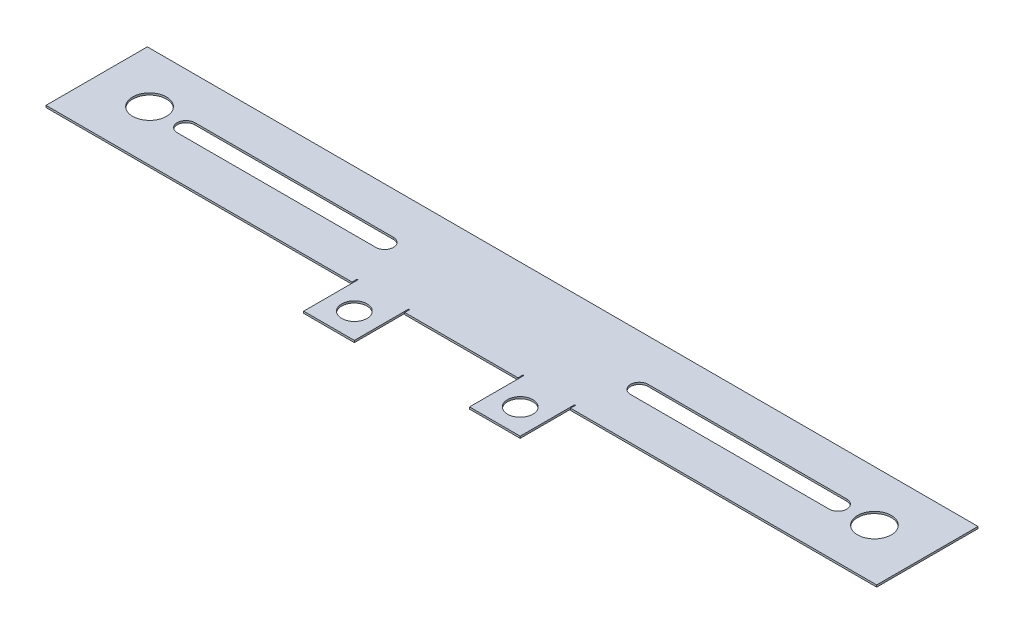
ISO-10303-21;
HEADER;
FILE_DESCRIPTION(('STEP AP214'),'2;1');
FILE_NAME('part.step','',(''),(''),'','','');
FILE_SCHEMA(('AUTOMOTIVE_DESIGN { 1 0 10303 214 1 1 1 1 }'));
ENDSEC;
DATA;
#1=APPLICATION_CONTEXT('core data for automotive mechanical design processes');
#2=APPLICATION_PROTOCOL_DEFINITION('international standard','automotive_design',2000,#1);
#3=PRODUCT_CONTEXT('',#1,'mechanical');
#4=PRODUCT('Part','Part','',(#3));
#5=PRODUCT_RELATED_PRODUCT_CATEGORY('part','',(#4));
#6=PRODUCT_DEFINITION_FORMATION('','',#4);
#7=PRODUCT_DEFINITION_CONTEXT('part definition',#1,'design');
#8=PRODUCT_DEFINITION('design','',#6,#7);
#9=PRODUCT_DEFINITION_SHAPE('','',#8);
#10=(LENGTH_UNIT() NAMED_UNIT(*) SI_UNIT(.MILLI.,.METRE.));
#11=(NAMED_UNIT(*) PLANE_ANGLE_UNIT() SI_UNIT($,.RADIAN.));
#12=(NAMED_UNIT(*) SI_UNIT($,.STERADIAN.) SOLID_ANGLE_UNIT());
#13=UNCERTAINTY_MEASURE_WITH_UNIT(LENGTH_MEASURE(1.E-05),#10,'distance_accuracy_value','');
#14=(GEOMETRIC_REPRESENTATION_CONTEXT(3) GLOBAL_UNCERTAINTY_ASSIGNED_CONTEXT((#13)) GLOBAL_UNIT_ASSIGNED_CONTEXT((#10,
#11,#12)) REPRESENTATION_CONTEXT('',''));
#15=CARTESIAN_POINT('',(0.,0.,0.));
#16=DIRECTION('',(0.,0.,1.));
#17=DIRECTION('',(1.,0.,0.));
#18=AXIS2_PLACEMENT_3D('',#15,#16,#17);
#19=CARTESIAN_POINT('',(-74.2260306865542,-15.1383999999999,-19.05));
#20=DIRECTION('',(0.,0.,-1.));
#21=DIRECTION('',(0.,-1.,0.));
#22=AXIS2_PLACEMENT_3D('',#19,#20,#21);
#23=PLANE('',#22);
#24=DIRECTION('',(1.,0.,0.));
#25=VECTOR('',#24,1.);
#26=CARTESIAN_POINT('',(-74.9626306865541,-15.8749999999999,-19.05));
#27=LINE('',#26,#25);
#28=CARTESIAN_POINT('',(-247.02729221072,-15.8749999999998,-19.05));
#29=VERTEX_POINT('',#28);
#30=CARTESIAN_POINT('',(65.3520308376111,-15.875,-19.05));
#31=VERTEX_POINT('',#30);
#32=EDGE_CURVE('E291',#29,#31,#27,.T.);
#33=ORIENTED_EDGE('',*,*,#32,.T.);
#34=DIRECTION('',(0.,-1.,0.));
#35=VECTOR('',#34,1.);
#36=CARTESIAN_POINT('',(65.3520308376111,-16.6116,-19.05));
#37=LINE('',#36,#35);
#38=CARTESIAN_POINT('',(65.3520308376111,-16.6116,-19.05));
#39=VERTEX_POINT('',#38);
#40=EDGE_CURVE('E688',#31,#39,#37,.T.);
#41=ORIENTED_EDGE('',*,*,#40,.T.);
#42=DIRECTION('',(-1.,0.,0.));
#43=VECTOR('',#42,1.);
#44=CARTESIAN_POINT('',(-74.9626306865541,-16.6115999999999,-19.05));
#45=LINE('',#44,#43);
#46=CARTESIAN_POINT('',(-247.02729221072,-16.6115999999998,-19.05));
#47=VERTEX_POINT('',#46);
#48=EDGE_CURVE('E185',#47,#39,#45,.F.);
#49=ORIENTED_EDGE('',*,*,#48,.F.);
#50=DIRECTION('',(0.,-1.,0.));
#51=VECTOR('',#50,1.);
#52=CARTESIAN_POINT('',(-247.02729221072,-16.6115999999998,-19.05));
#53=LINE('',#52,#51);
#54=EDGE_CURVE('E430',#29,#47,#53,.T.);
#55=ORIENTED_EDGE('',*,*,#54,.F.);
#56=EDGE_LOOP('',(#33,#41,#49,#55));
#57=FACE_BOUND('',#56,.T.);
#58=ADVANCED_FACE('F181',(#57),#23,.T.);
#59=CARTESIAN_POINT('',(-107.449230686554,-15.1383999999999,19.05));
#60=DIRECTION('',(0.,0.,1.));
#61=DIRECTION('',(0.,1.,0.));
#62=AXIS2_PLACEMENT_3D('',#59,#60,#61);
#63=PLANE('',#62);
#64=DIRECTION('',(1.,0.,0.));
#65=VECTOR('',#64,1.);
#66=CARTESIAN_POINT('',(-74.9626306865541,-15.8749999999999,19.05));
#67=LINE('',#66,#65);
#68=CARTESIAN_POINT('',(-112.126179988145,-15.8749999999999,19.05));
#69=VERTEX_POINT('',#68);
#70=CARTESIAN_POINT('',(-69.5490813849629,-15.8749999999999,19.05));
#71=VERTEX_POINT('',#70);
#72=EDGE_CURVE('E192',#69,#71,#67,.T.);
#73=ORIENTED_EDGE('',*,*,#72,.F.);
#74=DIRECTION('',(0.,1.,0.));
#75=VECTOR('',#74,1.);
#76=CARTESIAN_POINT('',(-112.126179988145,-16.6115999999999,19.05));
#77=LINE('',#76,#75);
#78=CARTESIAN_POINT('',(-112.126179988145,-16.6115999999999,19.05));
#79=VERTEX_POINT('',#78);
#80=EDGE_CURVE('E488',#79,#69,#77,.T.);
#81=ORIENTED_EDGE('',*,*,#80,.F.);
#82=DIRECTION('',(-1.,0.,0.));
#83=VECTOR('',#82,1.);
#84=CARTESIAN_POINT('',(-74.9626306865541,-16.6115999999999,19.05));
#85=LINE('',#84,#83);
#86=CARTESIAN_POINT('',(-69.5490813849629,-16.6115999999999,19.05));
#87=VERTEX_POINT('',#86);
#88=EDGE_CURVE('E13',#79,#87,#85,.F.);
#89=ORIENTED_EDGE('',*,*,#88,.T.);
#90=DIRECTION('',(0.,1.,0.));
#91=VECTOR('',#90,1.);
#92=CARTESIAN_POINT('',(-69.5490813849629,-16.6115999999999,19.05));
#93=LINE('',#92,#91);
#94=EDGE_CURVE('E546',#87,#71,#93,.T.);
#95=ORIENTED_EDGE('',*,*,#94,.T.);
#96=EDGE_LOOP('',(#73,#81,#89,#95));
#97=FACE_BOUND('',#96,.T.);
#98=ADVANCED_FACE('F719',(#97),#63,.T.);
#99=CARTESIAN_POINT('',(63.5,-15.875,19.05));
#100=DIRECTION('',(0.,1.,0.));
#101=DIRECTION('',(-1.,0.,0.));
#102=AXIS2_PLACEMENT_3D('',#99,#100,#101);
#103=PLANE('',#102);
#104=ORIENTED_EDGE('',*,*,#32,.F.);
#105=DIRECTION('',(0.,0.,1.));
#106=VECTOR('',#105,1.);
#107=CARTESIAN_POINT('',(-247.02729221072,-15.8749999999998,0.));
#108=LINE('',#107,#106);
#109=CARTESIAN_POINT('',(-247.02729221072,-15.8749999999998,19.05));
#110=VERTEX_POINT('',#109);
#111=EDGE_CURVE('E412',#29,#110,#108,.T.);
#112=ORIENTED_EDGE('',*,*,#111,.T.);
#113=DIRECTION('',(1.,0.,0.));
#114=VECTOR('',#113,1.);
#115=CARTESIAN_POINT('',(-142.978696977874,-15.8749999999999,19.05));
#116=LINE('',#115,#114);
#117=CARTESIAN_POINT('',(-131.912779988145,-15.8749999999999,19.05));
#118=VERTEX_POINT('',#117);
#119=EDGE_CURVE('E395',#110,#118,#116,.T.);
#120=ORIENTED_EDGE('',*,*,#119,.T.);
#121=DIRECTION('',(0.,0.,-1.));
#122=VECTOR('',#121,1.);
#123=CARTESIAN_POINT('',(-131.912779988145,-15.8749999999999,19.05));
#124=LINE('',#123,#122);
#125=CARTESIAN_POINT('',(-131.912779988145,-15.8749999999999,17.2085));
#126=VERTEX_POINT('',#125);
#127=EDGE_CURVE('E407',#118,#126,#124,.T.);
#128=ORIENTED_EDGE('',*,*,#127,.T.);
#129=DIRECTION('',(1.,0.,0.));
#130=VECTOR('',#129,1.);
#131=CARTESIAN_POINT('',(-142.978696977874,-15.8749999999999,17.2085));
#132=LINE('',#131,#130);
#133=CARTESIAN_POINT('',(-131.544479988145,-15.8749999999999,17.2085));
#134=VERTEX_POINT('',#133);
#135=EDGE_CURVE('E455',#126,#134,#132,.T.);
#136=ORIENTED_EDGE('',*,*,#135,.T.);
#137=DIRECTION('',(0.,0.,1.));
#138=VECTOR('',#137,1.);
#139=CARTESIAN_POINT('',(-131.544479988145,-15.8749999999999,1.96417286147569));
#140=LINE('',#139,#138);
#141=CARTESIAN_POINT('',(-131.544479988145,-15.8749999999998,37.6257728614757));
#142=VERTEX_POINT('',#141);
#143=EDGE_CURVE('E517',#134,#142,#140,.T.);
#144=ORIENTED_EDGE('',*,*,#143,.T.);
#145=DIRECTION('',(1.,0.,0.));
#146=VECTOR('',#145,1.);
#147=CARTESIAN_POINT('',(-170.47500354803,-15.8749999999998,37.6257728614757));
#148=LINE('',#147,#146);
#149=CARTESIAN_POINT('',(-112.494479988145,-15.8749999999998,37.6257728614757));
#150=VERTEX_POINT('',#149);
#151=EDGE_CURVE('E514',#142,#150,#148,.T.);
#152=ORIENTED_EDGE('',*,*,#151,.T.);
#153=DIRECTION('',(0.,0.,-1.));
#154=VECTOR('',#153,1.);
#155=CARTESIAN_POINT('',(-112.494479988145,-15.8749999999999,1.96417286147569));
#156=LINE('',#155,#154);
#157=CARTESIAN_POINT('',(-112.494479988145,-15.8749999999999,17.2085));
#158=VERTEX_POINT('',#157);
#159=EDGE_CURVE('E511',#150,#158,#156,.T.);
#160=ORIENTED_EDGE('',*,*,#159,.T.);
#161=DIRECTION('',(1.,0.,0.));
#162=VECTOR('',#161,1.);
#163=CARTESIAN_POINT('',(-142.978696977874,-15.8749999999999,17.2085));
#164=LINE('',#163,#162);
#165=CARTESIAN_POINT('',(-112.126179988145,-15.8749999999999,17.2085));
#166=VERTEX_POINT('',#165);
#167=EDGE_CURVE('E452',#158,#166,#164,.T.);
#168=ORIENTED_EDGE('',*,*,#167,.T.);
#169=DIRECTION('',(0.,0.,1.));
#170=VECTOR('',#169,1.);
#171=CARTESIAN_POINT('',(-112.126179988145,-15.8749999999999,19.05));
#172=LINE('',#171,#170);
#173=EDGE_CURVE('E447',#166,#69,#172,.T.);
#174=ORIENTED_EDGE('',*,*,#173,.T.);
#175=ORIENTED_EDGE('',*,*,#72,.T.);
#176=DIRECTION('',(0.,0.,-1.));
#177=VECTOR('',#176,1.);
#178=CARTESIAN_POINT('',(-69.5490813849629,-15.8749999999999,19.05));
#179=LINE('',#178,#177);
#180=CARTESIAN_POINT('',(-69.5490813849629,-15.8749999999999,17.2085));
#181=VERTEX_POINT('',#180);
#182=EDGE_CURVE('E561',#71,#181,#179,.T.);
#183=ORIENTED_EDGE('',*,*,#182,.T.);
#184=DIRECTION('',(1.,0.,0.));
#185=VECTOR('',#184,1.);
#186=CARTESIAN_POINT('',(-38.6965643952344,-15.8749999999999,17.2085));
#187=LINE('',#186,#185);
#188=CARTESIAN_POINT('',(-69.1807813849629,-15.8749999999999,17.2085));
#189=VERTEX_POINT('',#188);
#190=EDGE_CURVE('E557',#181,#189,#187,.T.);
#191=ORIENTED_EDGE('',*,*,#190,.T.);
#192=DIRECTION('',(0.,0.,1.));
#193=VECTOR('',#192,1.);
#194=CARTESIAN_POINT('',(-69.1807813849629,-15.8749999999999,18.5757728614757));
#195=LINE('',#194,#193);
#196=CARTESIAN_POINT('',(-69.1807813849629,-15.8749999999998,37.6257728614757));
#197=VERTEX_POINT('',#196);
#198=EDGE_CURVE('E624',#197,#189,#195,.F.);
#199=ORIENTED_EDGE('',*,*,#198,.F.);
#200=DIRECTION('',(1.,0.,0.));
#201=VECTOR('',#200,1.);
#202=CARTESIAN_POINT('',(-69.1807813849629,-15.8749999999998,37.6257728614757));
#203=LINE('',#202,#201);
#204=CARTESIAN_POINT('',(-50.1307813849629,-15.8749999999999,37.6257728614757));
#205=VERTEX_POINT('',#204);
#206=EDGE_CURVE('E634',#205,#197,#203,.F.);
#207=ORIENTED_EDGE('',*,*,#206,.F.);
#208=DIRECTION('',(0.,0.,-1.));
#209=VECTOR('',#208,1.);
#210=CARTESIAN_POINT('',(-50.1307813849629,-15.8749999999999,37.6257728614757));
#211=LINE('',#210,#209);
#212=CARTESIAN_POINT('',(-50.1307813849629,-15.8749999999999,17.2085));
#213=VERTEX_POINT('',#212);
#214=EDGE_CURVE('E642',#213,#205,#211,.F.);
#215=ORIENTED_EDGE('',*,*,#214,.F.);
#216=DIRECTION('',(1.,0.,0.));
#217=VECTOR('',#216,1.);
#218=CARTESIAN_POINT('',(-38.6965643952344,-15.8749999999999,17.2085));
#219=LINE('',#218,#217);
#220=CARTESIAN_POINT('',(-49.7624813849629,-15.8749999999999,17.2085));
#221=VERTEX_POINT('',#220);
#222=EDGE_CURVE('E554',#213,#221,#219,.T.);
#223=ORIENTED_EDGE('',*,*,#222,.T.);
#224=DIRECTION('',(0.,0.,1.));
#225=VECTOR('',#224,1.);
#226=CARTESIAN_POINT('',(-49.7624813849629,-15.8749999999999,19.05));
#227=LINE('',#226,#225);
#228=CARTESIAN_POINT('',(-49.7624813849629,-15.8749999999999,19.05));
#229=VERTEX_POINT('',#228);
#230=EDGE_CURVE('E550',#221,#229,#227,.T.);
#231=ORIENTED_EDGE('',*,*,#230,.T.);
#232=DIRECTION('',(1.,0.,0.));
#233=VECTOR('',#232,1.);
#234=CARTESIAN_POINT('',(64.9298475640698,-15.875,19.05));
#235=LINE('',#234,#233);
#236=CARTESIAN_POINT('',(65.3520308376111,-15.875,19.05));
#237=VERTEX_POINT('',#236);
#238=EDGE_CURVE('E681',#229,#237,#235,.T.);
#239=ORIENTED_EDGE('',*,*,#238,.T.);
#240=DIRECTION('',(0.,0.,1.));
#241=VECTOR('',#240,1.);
#242=CARTESIAN_POINT('',(65.3520308376111,-15.875,0.));
#243=LINE('',#242,#241);
#244=EDGE_CURVE('E685',#237,#31,#243,.F.);
#245=ORIENTED_EDGE('',*,*,#244,.T.);
#246=EDGE_LOOP('',(#104,#112,#120,#128,#136,#144,#152,#160,#168,#174,#175,#183,#191,#199,#207,
#215,#223,#231,#239,#245));
#247=FACE_BOUND('',#246,.T.);
#248=CARTESIAN_POINT('',(-213.425261373108,-15.8749999999998,0.));
#249=DIRECTION('',(0.,1.,0.));
#250=DIRECTION('',(-1.,0.,0.));
#251=AXIS2_PLACEMENT_3D('',#248,#249,#250);
#252=CIRCLE('',#251,3.30200000000001);
#253=CARTESIAN_POINT('',(-213.425261373108,-15.8749999999998,-3.30200000000003));
#254=VERTEX_POINT('',#253);
#255=CARTESIAN_POINT('',(-213.425261373109,-15.8749999999999,3.302));
#256=VERTEX_POINT('',#255);
#257=EDGE_CURVE('E797',#254,#256,#252,.T.);
#258=ORIENTED_EDGE('',*,*,#257,.F.);
#259=DIRECTION('',(-1.,0.,0.));
#260=VECTOR('',#259,1.);
#261=CARTESIAN_POINT('',(-142.978696977874,-15.8749999999999,-3.30200000000001));
#262=LINE('',#261,#260);
#263=CARTESIAN_POINT('',(-138.72500354803,-15.8749999999999,-3.30200000000002));
#264=VERTEX_POINT('',#263);
#265=EDGE_CURVE('E373',#264,#254,#262,.T.);
#266=ORIENTED_EDGE('',*,*,#265,.F.);
#267=CARTESIAN_POINT('',(-138.72500354803,-15.8749999999999,0.));
#268=DIRECTION('',(0.,1.,0.));
#269=DIRECTION('',(-1.,0.,0.));
#270=AXIS2_PLACEMENT_3D('',#267,#268,#269);
#271=CIRCLE('',#270,3.30200000000001);
#272=CARTESIAN_POINT('',(-138.72500354803,-15.8749999999999,3.30200000000001));
#273=VERTEX_POINT('',#272);
#274=EDGE_CURVE('E502',#273,#264,#271,.T.);
#275=ORIENTED_EDGE('',*,*,#274,.F.);
#276=DIRECTION('',(1.,0.,0.));
#277=VECTOR('',#276,1.);
#278=CARTESIAN_POINT('',(-142.978696977874,-15.8749999999999,3.30200000000001));
#279=LINE('',#278,#277);
#280=EDGE_CURVE('E508',#256,#273,#279,.T.);
#281=ORIENTED_EDGE('',*,*,#280,.F.);
#282=EDGE_LOOP('',(#258,#266,#275,#281));
#283=FACE_BOUND('',#282,.T.);
#284=DIRECTION('',(-1.,0.,0.));
#285=VECTOR('',#284,1.);
#286=CARTESIAN_POINT('',(63.5,-15.875,-3.30200000000003));
#287=LINE('',#286,#285);
#288=CARTESIAN_POINT('',(31.75,-15.875,-3.30200000000002));
#289=VERTEX_POINT('',#288);
#290=CARTESIAN_POINT('',(-42.9502578250785,-15.8749999999999,-3.30200000000002));
#291=VERTEX_POINT('',#290);
#292=EDGE_CURVE('E664',#289,#291,#287,.T.);
#293=ORIENTED_EDGE('',*,*,#292,.F.);
#294=CARTESIAN_POINT('',(31.75,-15.875,0.));
#295=DIRECTION('',(0.,1.,0.));
#296=DIRECTION('',(-1.,0.,0.));
#297=AXIS2_PLACEMENT_3D('',#294,#295,#296);
#298=CIRCLE('',#297,3.30200000000001);
#299=CARTESIAN_POINT('',(31.75,-15.875,3.302));
#300=VERTEX_POINT('',#299);
#301=EDGE_CURVE('E667',#300,#289,#298,.T.);
#302=ORIENTED_EDGE('',*,*,#301,.F.);
#303=DIRECTION('',(1.,0.,0.));
#304=VECTOR('',#303,1.);
#305=CARTESIAN_POINT('',(63.5,-15.875,3.30199999999999));
#306=LINE('',#305,#304);
#307=CARTESIAN_POINT('',(-42.9502578250785,-15.8749999999999,3.30200000000001));
#308=VERTEX_POINT('',#307);
#309=EDGE_CURVE('E674',#308,#300,#306,.T.);
#310=ORIENTED_EDGE('',*,*,#309,.F.);
#311=CARTESIAN_POINT('',(-42.9502578250785,-15.8749999999999,0.));
#312=DIRECTION('',(0.,1.,0.));
#313=DIRECTION('',(-1.,0.,0.));
#314=AXIS2_PLACEMENT_3D('',#311,#312,#313);
#315=CIRCLE('',#314,3.30200000000001);
#316=EDGE_CURVE('E606',#291,#308,#315,.T.);
#317=ORIENTED_EDGE('',*,*,#316,.F.);
#318=EDGE_LOOP('',(#293,#302,#310,#317));
#319=FACE_BOUND('',#318,.T.);
#320=CARTESIAN_POINT('',(45.4566728135002,-15.875,0.));
#321=DIRECTION('',(0.,1.,0.));
#322=DIRECTION('',(-1.,0.,0.));
#323=AXIS2_PLACEMENT_3D('',#320,#321,#322);
#324=CIRCLE('',#323,6.35);
#325=CARTESIAN_POINT('',(39.1066728135002,-15.875,0.));
#326=VERTEX_POINT('',#325);
#327=EDGE_CURVE('E677',#326,#326,#324,.T.);
#328=ORIENTED_EDGE('',*,*,#327,.F.);
#329=EDGE_LOOP('',(#328));
#330=FACE_BOUND('',#329,.T.);
#331=CARTESIAN_POINT('',(-59.6557813849629,-15.8749999999999,28.1007728614757));
#332=DIRECTION('',(0.,-1.,0.));
#333=DIRECTION('',(-1.,0.,0.));
#334=AXIS2_PLACEMENT_3D('',#331,#332,#333);
#335=CIRCLE('',#334,4.7625);
#336=CARTESIAN_POINT('',(-64.4182813849629,-15.8749999999999,28.1007728614757));
#337=VERTEX_POINT('',#336);
#338=EDGE_CURVE('E610',#337,#337,#335,.T.);
#339=ORIENTED_EDGE('',*,*,#338,.T.);
#340=EDGE_LOOP('',(#339));
#341=FACE_BOUND('',#340,.T.);
#342=CARTESIAN_POINT('',(-122.019479988145,-15.8749999999999,28.1007728614757));
#343=DIRECTION('',(0.,-1.,0.));
#344=DIRECTION('',(1.,0.,0.));
#345=AXIS2_PLACEMENT_3D('',#342,#343,#344);
#346=CIRCLE('',#345,4.7625);
#347=CARTESIAN_POINT('',(-117.256979988145,-15.8749999999999,28.1007728614757));
#348=VERTEX_POINT('',#347);
#349=EDGE_CURVE('E526',#348,#348,#346,.F.);
#350=ORIENTED_EDGE('',*,*,#349,.F.);
#351=EDGE_LOOP('',(#350));
#352=FACE_BOUND('',#351,.T.);
#353=CARTESIAN_POINT('',(-227.131934186609,-15.8749999999998,0.));
#354=DIRECTION('',(0.,1.,0.));
#355=DIRECTION('',(-1.,0.,0.));
#356=AXIS2_PLACEMENT_3D('',#353,#354,#355);
#357=CIRCLE('',#356,6.35);
#358=CARTESIAN_POINT('',(-233.481934186609,-15.8749999999998,0.));
#359=VERTEX_POINT('',#358);
#360=EDGE_CURVE('E420',#359,#359,#357,.T.);
#361=ORIENTED_EDGE('',*,*,#360,.F.);
#362=EDGE_LOOP('',(#361));
#363=FACE_BOUND('',#362,.T.);
#364=ADVANCED_FACE('F183',(#247,#283,#319,#330,#341,#352,#363),#103,.T.);
#365=CARTESIAN_POINT('',(-74.9626306865541,-16.6115999999999,19.05));
#366=DIRECTION('',(0.,1.,0.));
#367=DIRECTION('',(0.,0.,-1.));
#368=AXIS2_PLACEMENT_3D('',#365,#366,#367);
#369=PLANE('',#368);
#370=DIRECTION('',(0.,0.,1.));
#371=VECTOR('',#370,1.);
#372=CARTESIAN_POINT('',(-247.02729221072,-16.6115999999998,0.));
#373=LINE('',#372,#371);
#374=CARTESIAN_POINT('',(-247.02729221072,-16.6115999999998,19.05));
#375=VERTEX_POINT('',#374);
#376=EDGE_CURVE('E414',#47,#375,#373,.T.);
#377=ORIENTED_EDGE('',*,*,#376,.F.);
#378=ORIENTED_EDGE('',*,*,#48,.T.);
#379=DIRECTION('',(0.,0.,-1.));
#380=VECTOR('',#379,1.);
#381=CARTESIAN_POINT('',(65.3520308376111,-16.6116,0.));
#382=LINE('',#381,#380);
#383=CARTESIAN_POINT('',(65.3520308376111,-16.6116,19.05));
#384=VERTEX_POINT('',#383);
#385=EDGE_CURVE('E694',#384,#39,#382,.T.);
#386=ORIENTED_EDGE('',*,*,#385,.F.);
#387=DIRECTION('',(1.,0.,0.));
#388=VECTOR('',#387,1.);
#389=CARTESIAN_POINT('',(64.9298475640698,-16.6116,19.05));
#390=LINE('',#389,#388);
#391=CARTESIAN_POINT('',(-49.7624813849629,-16.6115999999999,19.05));
#392=VERTEX_POINT('',#391);
#393=EDGE_CURVE('E691',#392,#384,#390,.T.);
#394=ORIENTED_EDGE('',*,*,#393,.F.);
#395=DIRECTION('',(0.,0.,1.));
#396=VECTOR('',#395,1.);
#397=CARTESIAN_POINT('',(-49.7624813849629,-16.6115999999999,17.2085));
#398=LINE('',#397,#396);
#399=CARTESIAN_POINT('',(-49.7624813849629,-16.6115999999999,17.2085));
#400=VERTEX_POINT('',#399);
#401=EDGE_CURVE('E594',#400,#392,#398,.T.);
#402=ORIENTED_EDGE('',*,*,#401,.F.);
#403=DIRECTION('',(1.,0.,0.));
#404=VECTOR('',#403,1.);
#405=CARTESIAN_POINT('',(-50.1307813849629,-16.6115999999999,17.2085));
#406=LINE('',#405,#404);
#407=CARTESIAN_POINT('',(-50.1307813849629,-16.6115999999999,17.2085));
#408=VERTEX_POINT('',#407);
#409=EDGE_CURVE('E586',#408,#400,#406,.T.);
#410=ORIENTED_EDGE('',*,*,#409,.F.);
#411=DIRECTION('',(0.,0.,1.));
#412=VECTOR('',#411,1.);
#413=CARTESIAN_POINT('',(-50.1307813849629,-16.6116,1.96417286147569));
#414=LINE('',#413,#412);
#415=CARTESIAN_POINT('',(-50.1307813849629,-16.6115999999998,37.6257728614757));
#416=VERTEX_POINT('',#415);
#417=EDGE_CURVE('E618',#408,#416,#414,.T.);
#418=ORIENTED_EDGE('',*,*,#417,.T.);
#419=DIRECTION('',(-1.,0.,0.));
#420=VECTOR('',#419,1.);
#421=CARTESIAN_POINT('',(-11.2002578250785,-16.6115999999999,37.6257728614757));
#422=LINE('',#421,#420);
#423=CARTESIAN_POINT('',(-69.1807813849629,-16.6115999999998,37.6257728614757));
#424=VERTEX_POINT('',#423);
#425=EDGE_CURVE('E614',#416,#424,#422,.T.);
#426=ORIENTED_EDGE('',*,*,#425,.T.);
#427=DIRECTION('',(0.,0.,-1.));
#428=VECTOR('',#427,1.);
#429=CARTESIAN_POINT('',(-69.1807813849629,-16.6116,1.96417286147569));
#430=LINE('',#429,#428);
#431=CARTESIAN_POINT('',(-69.1807813849629,-16.6115999999999,17.2085));
#432=VERTEX_POINT('',#431);
#433=EDGE_CURVE('E621',#424,#432,#430,.T.);
#434=ORIENTED_EDGE('',*,*,#433,.T.);
#435=DIRECTION('',(1.,0.,0.));
#436=VECTOR('',#435,1.);
#437=CARTESIAN_POINT('',(-69.5490813849629,-16.6115999999999,17.2085));
#438=LINE('',#437,#436);
#439=CARTESIAN_POINT('',(-69.5490813849629,-16.6115999999999,17.2085));
#440=VERTEX_POINT('',#439);
#441=EDGE_CURVE('E201',#440,#432,#438,.T.);
#442=ORIENTED_EDGE('',*,*,#441,.F.);
#443=DIRECTION('',(0.,0.,-1.));
#444=VECTOR('',#443,1.);
#445=CARTESIAN_POINT('',(-69.5490813849629,-16.6115999999999,19.05));
#446=LINE('',#445,#444);
#447=EDGE_CURVE('E568',#87,#440,#446,.T.);
#448=ORIENTED_EDGE('',*,*,#447,.F.);
#449=ORIENTED_EDGE('',*,*,#88,.F.);
#450=DIRECTION('',(0.,0.,1.));
#451=VECTOR('',#450,1.);
#452=CARTESIAN_POINT('',(-112.126179988145,-16.6115999999999,17.2085));
#453=LINE('',#452,#451);
#454=CARTESIAN_POINT('',(-112.126179988145,-16.6115999999999,17.2085));
#455=VERTEX_POINT('',#454);
#456=EDGE_CURVE('E492',#455,#79,#453,.T.);
#457=ORIENTED_EDGE('',*,*,#456,.F.);
#458=DIRECTION('',(1.,0.,0.));
#459=VECTOR('',#458,1.);
#460=CARTESIAN_POINT('',(-112.494479988145,-16.6115999999999,17.2085));
#461=LINE('',#460,#459);
#462=CARTESIAN_POINT('',(-112.494479988145,-16.6115999999999,17.2085));
#463=VERTEX_POINT('',#462);
#464=EDGE_CURVE('E484',#463,#455,#461,.T.);
#465=ORIENTED_EDGE('',*,*,#464,.F.);
#466=DIRECTION('',(0.,0.,1.));
#467=VECTOR('',#466,1.);
#468=CARTESIAN_POINT('',(-112.494479988145,-16.6115999999999,18.5757728614757));
#469=LINE('',#468,#467);
#470=CARTESIAN_POINT('',(-112.494479988145,-16.6115999999998,37.6257728614757));
#471=VERTEX_POINT('',#470);
#472=EDGE_CURVE('E535',#471,#463,#469,.F.);
#473=ORIENTED_EDGE('',*,*,#472,.F.);
#474=DIRECTION('',(-1.,0.,0.));
#475=VECTOR('',#474,1.);
#476=CARTESIAN_POINT('',(-112.494479988145,-16.6115999999998,37.6257728614757));
#477=LINE('',#476,#475);
#478=CARTESIAN_POINT('',(-131.544479988145,-16.6115999999998,37.6257728614757));
#479=VERTEX_POINT('',#478);
#480=EDGE_CURVE('E364',#479,#471,#477,.F.);
#481=ORIENTED_EDGE('',*,*,#480,.F.);
#482=DIRECTION('',(0.,0.,-1.));
#483=VECTOR('',#482,1.);
#484=CARTESIAN_POINT('',(-131.544479988145,-16.6115999999998,37.6257728614757));
#485=LINE('',#484,#483);
#486=CARTESIAN_POINT('',(-131.544479988145,-16.6115999999999,17.2085));
#487=VERTEX_POINT('',#486);
#488=EDGE_CURVE('E357',#487,#479,#485,.F.);
#489=ORIENTED_EDGE('',*,*,#488,.F.);
#490=DIRECTION('',(1.,0.,0.));
#491=VECTOR('',#490,1.);
#492=CARTESIAN_POINT('',(-131.912779988145,-16.6115999999999,17.2085));
#493=LINE('',#492,#491);
#494=CARTESIAN_POINT('',(-131.912779988145,-16.6115999999999,17.2085));
#495=VERTEX_POINT('',#494);
#496=EDGE_CURVE('E299',#495,#487,#493,.T.);
#497=ORIENTED_EDGE('',*,*,#496,.F.);
#498=DIRECTION('',(0.,0.,-1.));
#499=VECTOR('',#498,1.);
#500=CARTESIAN_POINT('',(-131.912779988145,-16.6115999999999,19.05));
#501=LINE('',#500,#499);
#502=CARTESIAN_POINT('',(-131.912779988145,-16.6115999999999,19.05));
#503=VERTEX_POINT('',#502);
#504=EDGE_CURVE('E466',#503,#495,#501,.T.);
#505=ORIENTED_EDGE('',*,*,#504,.F.);
#506=DIRECTION('',(1.,0.,0.));
#507=VECTOR('',#506,1.);
#508=CARTESIAN_POINT('',(-142.978696977874,-16.6115999999999,19.05));
#509=LINE('',#508,#507);
#510=EDGE_CURVE('E433',#375,#503,#509,.T.);
#511=ORIENTED_EDGE('',*,*,#510,.F.);
#512=EDGE_LOOP('',(#377,#378,#386,#394,#402,#410,#418,#426,#434,#442,#448,#449,#457,#465,#473,
#481,#489,#497,#505,#511));
#513=FACE_BOUND('',#512,.T.);
#514=DIRECTION('',(-1.,0.,0.));
#515=VECTOR('',#514,1.);
#516=CARTESIAN_POINT('',(-142.978696977874,-16.6115999999999,-3.30200000000001));
#517=LINE('',#516,#515);
#518=CARTESIAN_POINT('',(-138.72500354803,-16.6115999999999,-3.30200000000002));
#519=VERTEX_POINT('',#518);
#520=CARTESIAN_POINT('',(-213.425261373109,-16.6115999999998,-3.30200000000003));
#521=VERTEX_POINT('',#520);
#522=EDGE_CURVE('E437',#519,#521,#517,.T.);
#523=ORIENTED_EDGE('',*,*,#522,.T.);
#524=CARTESIAN_POINT('',(-213.425261373109,-16.6115999999998,0.));
#525=DIRECTION('',(0.,1.,0.));
#526=DIRECTION('',(-1.,0.,0.));
#527=AXIS2_PLACEMENT_3D('',#524,#525,#526);
#528=CIRCLE('',#527,3.30200000000001);
#529=CARTESIAN_POINT('',(-213.425261373109,-16.6115999999998,3.302));
#530=VERTEX_POINT('',#529);
#531=EDGE_CURVE('E806',#521,#530,#528,.T.);
#532=ORIENTED_EDGE('',*,*,#531,.T.);
#533=DIRECTION('',(1.,0.,0.));
#534=VECTOR('',#533,1.);
#535=CARTESIAN_POINT('',(-142.978696977874,-16.6115999999999,3.30200000000001));
#536=LINE('',#535,#534);
#537=CARTESIAN_POINT('',(-138.72500354803,-16.6115999999999,3.30200000000001));
#538=VERTEX_POINT('',#537);
#539=EDGE_CURVE('E444',#530,#538,#536,.T.);
#540=ORIENTED_EDGE('',*,*,#539,.T.);
#541=CARTESIAN_POINT('',(-138.72500354803,-16.6115999999999,0.));
#542=DIRECTION('',(0.,1.,0.));
#543=DIRECTION('',(-1.,0.,0.));
#544=AXIS2_PLACEMENT_3D('',#541,#542,#543);
#545=CIRCLE('',#544,3.30200000000001);
#546=EDGE_CURVE('E440',#538,#519,#545,.T.);
#547=ORIENTED_EDGE('',*,*,#546,.T.);
#548=EDGE_LOOP('',(#523,#532,#540,#547));
#549=FACE_BOUND('',#548,.T.);
#550=DIRECTION('',(-1.,0.,0.));
#551=VECTOR('',#550,1.);
#552=CARTESIAN_POINT('',(63.5,-16.6116,-3.30200000000003));
#553=LINE('',#552,#551);
#554=CARTESIAN_POINT('',(31.75,-16.6116,-3.30200000000002));
#555=VERTEX_POINT('',#554);
#556=CARTESIAN_POINT('',(-42.9502578250785,-16.6115999999999,-3.30200000000002));
#557=VERTEX_POINT('',#556);
#558=EDGE_CURVE('E649',#555,#557,#553,.T.);
#559=ORIENTED_EDGE('',*,*,#558,.T.);
#560=CARTESIAN_POINT('',(-42.9502578250785,-16.6115999999999,0.));
#561=DIRECTION('',(0.,1.,0.));
#562=DIRECTION('',(-1.,0.,0.));
#563=AXIS2_PLACEMENT_3D('',#560,#561,#562);
#564=CIRCLE('',#563,3.30200000000001);
#565=CARTESIAN_POINT('',(-42.9502578250785,-16.6115999999999,3.30200000000001));
#566=VERTEX_POINT('',#565);
#567=EDGE_CURVE('E542',#557,#566,#564,.T.);
#568=ORIENTED_EDGE('',*,*,#567,.T.);
#569=DIRECTION('',(1.,0.,0.));
#570=VECTOR('',#569,1.);
#571=CARTESIAN_POINT('',(63.5,-16.6116,3.30199999999999));
#572=LINE('',#571,#570);
#573=CARTESIAN_POINT('',(31.75,-16.6116,3.302));
#574=VERTEX_POINT('',#573);
#575=EDGE_CURVE('E645',#566,#574,#572,.T.);
#576=ORIENTED_EDGE('',*,*,#575,.T.);
#577=CARTESIAN_POINT('',(31.75,-16.6116,0.));
#578=DIRECTION('',(0.,1.,0.));
#579=DIRECTION('',(-1.,0.,0.));
#580=AXIS2_PLACEMENT_3D('',#577,#578,#579);
#581=CIRCLE('',#580,3.30200000000001);
#582=EDGE_CURVE('E652',#574,#555,#581,.T.);
#583=ORIENTED_EDGE('',*,*,#582,.T.);
#584=EDGE_LOOP('',(#559,#568,#576,#583));
#585=FACE_BOUND('',#584,.T.);
#586=CARTESIAN_POINT('',(-59.6557813849629,-16.6115999999999,28.1007728614757));
#587=DIRECTION('',(0.,-1.,0.));
#588=DIRECTION('',(-1.,0.,0.));
#589=AXIS2_PLACEMENT_3D('',#586,#587,#588);
#590=CIRCLE('',#589,4.7625);
#591=CARTESIAN_POINT('',(-64.4182813849629,-16.6115999999999,28.1007728614757));
#592=VERTEX_POINT('',#591);
#593=EDGE_CURVE('E627',#592,#592,#590,.T.);
#594=ORIENTED_EDGE('',*,*,#593,.F.);
#595=EDGE_LOOP('',(#594));
#596=FACE_BOUND('',#595,.T.);
#597=CARTESIAN_POINT('',(45.4566728135002,-16.6116,0.));
#598=DIRECTION('',(0.,1.,0.));
#599=DIRECTION('',(-1.,0.,0.));
#600=AXIS2_PLACEMENT_3D('',#597,#598,#599);
#601=CIRCLE('',#600,6.35);
#602=CARTESIAN_POINT('',(39.1066728135002,-16.6116,0.));
#603=VERTEX_POINT('',#602);
#604=EDGE_CURVE('E656',#603,#603,#601,.T.);
#605=ORIENTED_EDGE('',*,*,#604,.T.);
#606=EDGE_LOOP('',(#605));
#607=FACE_BOUND('',#606,.T.);
#608=CARTESIAN_POINT('',(-122.019479988145,-16.6115999999999,28.1007728614757));
#609=DIRECTION('',(0.,-1.,0.));
#610=DIRECTION('',(1.,0.,0.));
#611=AXIS2_PLACEMENT_3D('',#608,#609,#610);
#612=CIRCLE('',#611,4.7625);
#613=CARTESIAN_POINT('',(-117.256979988145,-16.6115999999999,28.1007728614757));
#614=VERTEX_POINT('',#613);
#615=EDGE_CURVE('E520',#614,#614,#612,.F.);
#616=ORIENTED_EDGE('',*,*,#615,.T.);
#617=EDGE_LOOP('',(#616));
#618=FACE_BOUND('',#617,.T.);
#619=CARTESIAN_POINT('',(-227.131934186609,-16.6115999999998,0.));
#620=DIRECTION('',(0.,-1.,0.));
#621=DIRECTION('',(1.,0.,0.));
#622=AXIS2_PLACEMENT_3D('',#619,#620,#621);
#623=CIRCLE('',#622,6.35);
#624=CARTESIAN_POINT('',(-220.781934186609,-16.6115999999998,0.));
#625=VERTEX_POINT('',#624);
#626=EDGE_CURVE('E424',#625,#625,#623,.T.);
#627=ORIENTED_EDGE('',*,*,#626,.F.);
#628=EDGE_LOOP('',(#627));
#629=FACE_BOUND('',#628,.T.);
#630=ADVANCED_FACE('F703',(#513,#549,#585,#596,#607,#618,#629),#369,.F.);
#631=CARTESIAN_POINT('',(65.3520308376111,-16.6116,0.));
#632=DIRECTION('',(-1.,0.,0.));
#633=DIRECTION('',(0.,0.,-1.));
#634=AXIS2_PLACEMENT_3D('',#631,#632,#633);
#635=PLANE('',#634);
#636=ORIENTED_EDGE('',*,*,#40,.F.);
#637=ORIENTED_EDGE('',*,*,#244,.F.);
#638=DIRECTION('',(0.,-1.,0.));
#639=VECTOR('',#638,1.);
#640=CARTESIAN_POINT('',(65.3520308376111,-16.6116,19.05));
#641=LINE('',#640,#639);
#642=EDGE_CURVE('E283',#237,#384,#641,.T.);
#643=ORIENTED_EDGE('',*,*,#642,.T.);
#644=ORIENTED_EDGE('',*,*,#385,.T.);
#645=EDGE_LOOP('',(#636,#637,#643,#644));
#646=FACE_BOUND('',#645,.T.);
#647=ADVANCED_FACE('F705',(#646),#635,.F.);
#648=CARTESIAN_POINT('',(64.9298475640698,-16.6116,19.05));
#649=DIRECTION('',(0.,0.,-1.));
#650=DIRECTION('',(1.,0.,0.));
#651=AXIS2_PLACEMENT_3D('',#648,#649,#650);
#652=PLANE('',#651);
#653=ORIENTED_EDGE('',*,*,#238,.F.);
#654=DIRECTION('',(0.,1.,0.));
#655=VECTOR('',#654,1.);
#656=CARTESIAN_POINT('',(-49.7624813849629,-16.6115999999999,19.05));
#657=LINE('',#656,#655);
#658=EDGE_CURVE('E590',#392,#229,#657,.T.);
#659=ORIENTED_EDGE('',*,*,#658,.F.);
#660=ORIENTED_EDGE('',*,*,#393,.T.);
#661=ORIENTED_EDGE('',*,*,#642,.F.);
#662=EDGE_LOOP('',(#653,#659,#660,#661));
#663=FACE_BOUND('',#662,.T.);
#664=ADVANCED_FACE('F707',(#663),#652,.F.);
#665=CARTESIAN_POINT('',(45.4566728135002,-32.4866,0.));
#666=DIRECTION('',(0.,1.,0.));
#667=DIRECTION('',(-1.,0.,0.));
#668=AXIS2_PLACEMENT_3D('',#665,#666,#667);
#669=CYLINDRICAL_SURFACE('',#668,6.35);
#670=ORIENTED_EDGE('',*,*,#327,.T.);
#671=EDGE_LOOP('',(#670));
#672=FACE_BOUND('',#671,.T.);
#673=ORIENTED_EDGE('',*,*,#604,.F.);
#674=EDGE_LOOP('',(#673));
#675=FACE_BOUND('',#674,.T.);
#676=ADVANCED_FACE('F713',(#672,#675),#669,.F.);
#677=CARTESIAN_POINT('',(-31.75,-32.4866,3.30200000000001));
#678=DIRECTION('',(0.,0.,1.));
#679=DIRECTION('',(1.,0.,0.));
#680=AXIS2_PLACEMENT_3D('',#677,#678,#679);
#681=PLANE('',#680);
#682=ORIENTED_EDGE('',*,*,#575,.F.);
#683=DIRECTION('',(0.,1.,0.));
#684=VECTOR('',#683,1.);
#685=CARTESIAN_POINT('',(-42.9502578250785,-32.4865999999999,3.30200000000001));
#686=LINE('',#685,#684);
#687=EDGE_CURVE('E598',#566,#308,#686,.T.);
#688=ORIENTED_EDGE('',*,*,#687,.T.);
#689=ORIENTED_EDGE('',*,*,#309,.T.);
#690=DIRECTION('',(0.,1.,0.));
#691=VECTOR('',#690,1.);
#692=CARTESIAN_POINT('',(31.75,-32.4866,3.302));
#693=LINE('',#692,#691);
#694=EDGE_CURVE('E670',#574,#300,#693,.T.);
#695=ORIENTED_EDGE('',*,*,#694,.F.);
#696=EDGE_LOOP('',(#682,#688,#689,#695));
#697=FACE_BOUND('',#696,.T.);
#698=ADVANCED_FACE('F826',(#697),#681,.F.);
#699=CARTESIAN_POINT('',(31.75,-32.4866,0.));
#700=DIRECTION('',(0.,1.,0.));
#701=DIRECTION('',(0.,0.,1.));
#702=AXIS2_PLACEMENT_3D('',#699,#700,#701);
#703=CYLINDRICAL_SURFACE('',#702,3.30200000000001);
#704=ORIENTED_EDGE('',*,*,#694,.T.);
#705=ORIENTED_EDGE('',*,*,#301,.T.);
#706=DIRECTION('',(0.,1.,0.));
#707=VECTOR('',#706,1.);
#708=CARTESIAN_POINT('',(31.75,-32.4866,-3.30200000000002));
#709=LINE('',#708,#707);
#710=EDGE_CURVE('E660',#555,#289,#709,.T.);
#711=ORIENTED_EDGE('',*,*,#710,.F.);
#712=ORIENTED_EDGE('',*,*,#582,.F.);
#713=EDGE_LOOP('',(#704,#705,#711,#712));
#714=FACE_BOUND('',#713,.T.);
#715=ADVANCED_FACE('F832',(#714),#703,.F.);
#716=CARTESIAN_POINT('',(-31.75,-32.4866,-3.30200000000001));
#717=DIRECTION('',(0.,0.,-1.));
#718=DIRECTION('',(-1.,0.,0.));
#719=AXIS2_PLACEMENT_3D('',#716,#717,#718);
#720=PLANE('',#719);
#721=ORIENTED_EDGE('',*,*,#292,.T.);
#722=DIRECTION('',(0.,1.,0.));
#723=VECTOR('',#722,1.);
#724=CARTESIAN_POINT('',(-42.9502578250785,-32.4865999999999,-3.30200000000002));
#725=LINE('',#724,#723);
#726=EDGE_CURVE('E602',#557,#291,#725,.T.);
#727=ORIENTED_EDGE('',*,*,#726,.F.);
#728=ORIENTED_EDGE('',*,*,#558,.F.);
#729=ORIENTED_EDGE('',*,*,#710,.T.);
#730=EDGE_LOOP('',(#721,#727,#728,#729));
#731=FACE_BOUND('',#730,.T.);
#732=ADVANCED_FACE('F838',(#731),#720,.F.);
#733=CARTESIAN_POINT('',(-50.1307813849629,-15.8749999999999,37.6257728614757));
#734=DIRECTION('',(1.,0.,0.));
#735=DIRECTION('',(0.,-1.,0.));
#736=AXIS2_PLACEMENT_3D('',#733,#734,#735);
#737=PLANE('',#736);
#738=ORIENTED_EDGE('',*,*,#417,.F.);
#739=DIRECTION('',(0.,1.,0.));
#740=VECTOR('',#739,1.);
#741=CARTESIAN_POINT('',(-50.1307813849629,-16.6115999999999,17.2085));
#742=LINE('',#741,#740);
#743=EDGE_CURVE('E578',#408,#213,#742,.T.);
#744=ORIENTED_EDGE('',*,*,#743,.T.);
#745=ORIENTED_EDGE('',*,*,#214,.T.);
#746=DIRECTION('',(0.,-1.,0.));
#747=VECTOR('',#746,1.);
#748=CARTESIAN_POINT('',(-50.1307813849629,-15.8749999999999,37.6257728614757));
#749=LINE('',#748,#747);
#750=EDGE_CURVE('E638',#205,#416,#749,.T.);
#751=ORIENTED_EDGE('',*,*,#750,.T.);
#752=EDGE_LOOP('',(#738,#744,#745,#751));
#753=FACE_BOUND('',#752,.T.);
#754=ADVANCED_FACE('F842',(#753),#737,.T.);
#755=CARTESIAN_POINT('',(-69.1807813849629,-15.8749999999998,37.6257728614757));
#756=DIRECTION('',(0.,0.,1.));
#757=DIRECTION('',(0.,-1.,0.));
#758=AXIS2_PLACEMENT_3D('',#755,#756,#757);
#759=PLANE('',#758);
#760=ORIENTED_EDGE('',*,*,#425,.F.);
#761=ORIENTED_EDGE('',*,*,#750,.F.);
#762=ORIENTED_EDGE('',*,*,#206,.T.);
#763=DIRECTION('',(0.,-1.,0.));
#764=VECTOR('',#763,1.);
#765=CARTESIAN_POINT('',(-69.1807813849629,-15.8749999999998,37.6257728614757));
#766=LINE('',#765,#764);
#767=EDGE_CURVE('E631',#197,#424,#766,.T.);
#768=ORIENTED_EDGE('',*,*,#767,.T.);
#769=EDGE_LOOP('',(#760,#761,#762,#768));
#770=FACE_BOUND('',#769,.T.);
#771=ADVANCED_FACE('F846',(#770),#759,.T.);
#772=CARTESIAN_POINT('',(-59.6557813849629,-15.8749999999999,28.1007728614757));
#773=DIRECTION('',(0.,-1.,0.));
#774=DIRECTION('',(-1.,0.,0.));
#775=AXIS2_PLACEMENT_3D('',#772,#773,#774);
#776=CYLINDRICAL_SURFACE('',#775,4.7625);
#777=ORIENTED_EDGE('',*,*,#338,.F.);
#778=EDGE_LOOP('',(#777));
#779=FACE_BOUND('',#778,.T.);
#780=ORIENTED_EDGE('',*,*,#593,.T.);
#781=EDGE_LOOP('',(#780));
#782=FACE_BOUND('',#781,.T.);
#783=ADVANCED_FACE('F850',(#779,#782),#776,.F.);
#784=CARTESIAN_POINT('',(-69.1807813849629,-15.8749999999999,18.5757728614757));
#785=DIRECTION('',(-1.,0.,0.));
#786=DIRECTION('',(0.,1.,0.));
#787=AXIS2_PLACEMENT_3D('',#784,#785,#786);
#788=PLANE('',#787);
#789=ORIENTED_EDGE('',*,*,#198,.T.);
#790=DIRECTION('',(0.,1.,0.));
#791=VECTOR('',#790,1.);
#792=CARTESIAN_POINT('',(-69.1807813849629,-16.6115999999999,17.2085));
#793=LINE('',#792,#791);
#794=EDGE_CURVE('E572',#432,#189,#793,.T.);
#795=ORIENTED_EDGE('',*,*,#794,.F.);
#796=ORIENTED_EDGE('',*,*,#433,.F.);
#797=ORIENTED_EDGE('',*,*,#767,.F.);
#798=EDGE_LOOP('',(#789,#795,#796,#797));
#799=FACE_BOUND('',#798,.T.);
#800=ADVANCED_FACE('F854',(#799),#788,.T.);
#801=CARTESIAN_POINT('',(-42.9502578250785,-32.4865999999999,0.));
#802=DIRECTION('',(0.,1.,0.));
#803=DIRECTION('',(0.,0.,1.));
#804=AXIS2_PLACEMENT_3D('',#801,#802,#803);
#805=CYLINDRICAL_SURFACE('',#804,3.30200000000001);
#806=ORIENTED_EDGE('',*,*,#316,.T.);
#807=ORIENTED_EDGE('',*,*,#687,.F.);
#808=ORIENTED_EDGE('',*,*,#567,.F.);
#809=ORIENTED_EDGE('',*,*,#726,.T.);
#810=EDGE_LOOP('',(#806,#807,#808,#809));
#811=FACE_BOUND('',#810,.T.);
#812=ADVANCED_FACE('F858',(#811),#805,.F.);
#813=CARTESIAN_POINT('',(-49.7624813849629,-16.6115999999999,17.2085));
#814=DIRECTION('',(-1.,0.,0.));
#815=DIRECTION('',(0.,-1.,0.));
#816=AXIS2_PLACEMENT_3D('',#813,#814,#815);
#817=PLANE('',#816);
#818=ORIENTED_EDGE('',*,*,#230,.F.);
#819=DIRECTION('',(0.,1.,0.));
#820=VECTOR('',#819,1.);
#821=CARTESIAN_POINT('',(-49.7624813849629,-16.6115999999999,17.2085));
#822=LINE('',#821,#820);
#823=EDGE_CURVE('E582',#400,#221,#822,.T.);
#824=ORIENTED_EDGE('',*,*,#823,.F.);
#825=ORIENTED_EDGE('',*,*,#401,.T.);
#826=ORIENTED_EDGE('',*,*,#658,.T.);
#827=EDGE_LOOP('',(#818,#824,#825,#826));
#828=FACE_BOUND('',#827,.T.);
#829=ADVANCED_FACE('F862',(#828),#817,.T.);
#830=CARTESIAN_POINT('',(-50.1307813849629,-16.6115999999999,17.2085));
#831=DIRECTION('',(0.,0.,1.));
#832=DIRECTION('',(0.,-1.,0.));
#833=AXIS2_PLACEMENT_3D('',#830,#831,#832);
#834=PLANE('',#833);
#835=ORIENTED_EDGE('',*,*,#222,.F.);
#836=ORIENTED_EDGE('',*,*,#743,.F.);
#837=ORIENTED_EDGE('',*,*,#409,.T.);
#838=ORIENTED_EDGE('',*,*,#823,.T.);
#839=EDGE_LOOP('',(#835,#836,#837,#838));
#840=FACE_BOUND('',#839,.T.);
#841=ADVANCED_FACE('F866',(#840),#834,.T.);
#842=CARTESIAN_POINT('',(-69.5490813849629,-16.6115999999999,17.2085));
#843=DIRECTION('',(0.,0.,1.));
#844=DIRECTION('',(0.,-1.,0.));
#845=AXIS2_PLACEMENT_3D('',#842,#843,#844);
#846=PLANE('',#845);
#847=ORIENTED_EDGE('',*,*,#190,.F.);
#848=DIRECTION('',(0.,1.,0.));
#849=VECTOR('',#848,1.);
#850=CARTESIAN_POINT('',(-69.5490813849629,-16.6115999999999,17.2085));
#851=LINE('',#850,#849);
#852=EDGE_CURVE('E564',#440,#181,#851,.T.);
#853=ORIENTED_EDGE('',*,*,#852,.F.);
#854=ORIENTED_EDGE('',*,*,#441,.T.);
#855=ORIENTED_EDGE('',*,*,#794,.T.);
#856=EDGE_LOOP('',(#847,#853,#854,#855));
#857=FACE_BOUND('',#856,.T.);
#858=ADVANCED_FACE('F870',(#857),#846,.T.);
#859=CARTESIAN_POINT('',(-69.5490813849629,-16.6115999999999,19.05));
#860=DIRECTION('',(1.,0.,0.));
#861=DIRECTION('',(0.,1.,0.));
#862=AXIS2_PLACEMENT_3D('',#859,#860,#861);
#863=PLANE('',#862);
#864=ORIENTED_EDGE('',*,*,#182,.F.);
#865=ORIENTED_EDGE('',*,*,#94,.F.);
#866=ORIENTED_EDGE('',*,*,#447,.T.);
#867=ORIENTED_EDGE('',*,*,#852,.T.);
#868=EDGE_LOOP('',(#864,#865,#866,#867));
#869=FACE_BOUND('',#868,.T.);
#870=ADVANCED_FACE('F779',(#869),#863,.T.);
#871=CARTESIAN_POINT('',(-112.494479988145,-15.8749999999999,18.5757728614757));
#872=DIRECTION('',(-1.,0.,0.));
#873=DIRECTION('',(0.,-1.,0.));
#874=AXIS2_PLACEMENT_3D('',#871,#872,#873);
#875=PLANE('',#874);
#876=ORIENTED_EDGE('',*,*,#472,.T.);
#877=DIRECTION('',(0.,1.,0.));
#878=VECTOR('',#877,1.);
#879=CARTESIAN_POINT('',(-112.494479988145,-16.6115999999999,17.2085));
#880=LINE('',#879,#878);
#881=EDGE_CURVE('E476',#463,#158,#880,.T.);
#882=ORIENTED_EDGE('',*,*,#881,.T.);
#883=ORIENTED_EDGE('',*,*,#159,.F.);
#884=DIRECTION('',(0.,-1.,0.));
#885=VECTOR('',#884,1.);
#886=CARTESIAN_POINT('',(-112.494479988145,-15.8749999999998,37.6257728614757));
#887=LINE('',#886,#885);
#888=EDGE_CURVE('E538',#150,#471,#887,.T.);
#889=ORIENTED_EDGE('',*,*,#888,.T.);
#890=EDGE_LOOP('',(#876,#882,#883,#889));
#891=FACE_BOUND('',#890,.T.);
#892=ADVANCED_FACE('F775',(#891),#875,.F.);
#893=CARTESIAN_POINT('',(-112.494479988145,-15.8749999999998,37.6257728614757));
#894=DIRECTION('',(0.,0.,-1.));
#895=DIRECTION('',(0.,-1.,0.));
#896=AXIS2_PLACEMENT_3D('',#893,#894,#895);
#897=PLANE('',#896);
#898=ORIENTED_EDGE('',*,*,#480,.T.);
#899=ORIENTED_EDGE('',*,*,#888,.F.);
#900=ORIENTED_EDGE('',*,*,#151,.F.);
#901=DIRECTION('',(0.,-1.,0.));
#902=VECTOR('',#901,1.);
#903=CARTESIAN_POINT('',(-131.544479988145,-15.8749999999998,37.6257728614757));
#904=LINE('',#903,#902);
#905=EDGE_CURVE('E530',#142,#479,#904,.T.);
#906=ORIENTED_EDGE('',*,*,#905,.T.);
#907=EDGE_LOOP('',(#898,#899,#900,#906));
#908=FACE_BOUND('',#907,.T.);
#909=ADVANCED_FACE('F778',(#908),#897,.F.);
#910=CARTESIAN_POINT('',(-122.019479988145,-15.8749999999999,28.1007728614757));
#911=DIRECTION('',(0.,-1.,0.));
#912=DIRECTION('',(1.,0.,0.));
#913=AXIS2_PLACEMENT_3D('',#910,#911,#912);
#914=CYLINDRICAL_SURFACE('',#913,4.7625);
#915=ORIENTED_EDGE('',*,*,#349,.T.);
#916=EDGE_LOOP('',(#915));
#917=FACE_BOUND('',#916,.T.);
#918=ORIENTED_EDGE('',*,*,#615,.F.);
#919=EDGE_LOOP('',(#918));
#920=FACE_BOUND('',#919,.T.);
#921=ADVANCED_FACE('F782',(#917,#920),#914,.F.);
#922=CARTESIAN_POINT('',(-131.544479988145,-15.8749999999998,37.6257728614757));
#923=DIRECTION('',(1.,0.,0.));
#924=DIRECTION('',(0.,1.,0.));
#925=AXIS2_PLACEMENT_3D('',#922,#923,#924);
#926=PLANE('',#925);
#927=ORIENTED_EDGE('',*,*,#143,.F.);
#928=DIRECTION('',(0.,1.,0.));
#929=VECTOR('',#928,1.);
#930=CARTESIAN_POINT('',(-131.544479988145,-16.6115999999999,17.2085));
#931=LINE('',#930,#929);
#932=EDGE_CURVE('E470',#487,#134,#931,.T.);
#933=ORIENTED_EDGE('',*,*,#932,.F.);
#934=ORIENTED_EDGE('',*,*,#488,.T.);
#935=ORIENTED_EDGE('',*,*,#905,.F.);
#936=EDGE_LOOP('',(#927,#933,#934,#935));
#937=FACE_BOUND('',#936,.T.);
#938=ADVANCED_FACE('F730',(#937),#926,.F.);
#939=CARTESIAN_POINT('',(-138.72500354803,32.4866000000001,3.30200000000001));
#940=DIRECTION('',(0.,0.,1.));
#941=DIRECTION('',(-1.,0.,0.));
#942=AXIS2_PLACEMENT_3D('',#939,#940,#941);
#943=PLANE('',#942);
#944=ORIENTED_EDGE('',*,*,#539,.F.);
#945=DIRECTION('',(0.,-1.,0.));
#946=VECTOR('',#945,1.);
#947=CARTESIAN_POINT('',(-213.425261373109,32.4866000000002,3.302));
#948=LINE('',#947,#946);
#949=EDGE_CURVE('E800',#256,#530,#948,.T.);
#950=ORIENTED_EDGE('',*,*,#949,.F.);
#951=ORIENTED_EDGE('',*,*,#280,.T.);
#952=DIRECTION('',(0.,-1.,0.));
#953=VECTOR('',#952,1.);
#954=CARTESIAN_POINT('',(-138.72500354803,32.4866000000001,3.30200000000001));
#955=LINE('',#954,#953);
#956=EDGE_CURVE('E505',#273,#538,#955,.T.);
#957=ORIENTED_EDGE('',*,*,#956,.T.);
#958=EDGE_LOOP('',(#944,#950,#951,#957));
#959=FACE_BOUND('',#958,.T.);
#960=ADVANCED_FACE('F727',(#959),#943,.F.);
#961=CARTESIAN_POINT('',(-138.72500354803,32.4866000000001,0.));
#962=DIRECTION('',(0.,-1.,0.));
#963=DIRECTION('',(0.,0.,1.));
#964=AXIS2_PLACEMENT_3D('',#961,#962,#963);
#965=CYLINDRICAL_SURFACE('',#964,3.30200000000001);
#966=ORIENTED_EDGE('',*,*,#274,.T.);
#967=DIRECTION('',(0.,-1.,0.));
#968=VECTOR('',#967,1.);
#969=CARTESIAN_POINT('',(-138.72500354803,32.4866000000001,-3.30200000000002));
#970=LINE('',#969,#968);
#971=EDGE_CURVE('E498',#264,#519,#970,.T.);
#972=ORIENTED_EDGE('',*,*,#971,.T.);
#973=ORIENTED_EDGE('',*,*,#546,.F.);
#974=ORIENTED_EDGE('',*,*,#956,.F.);
#975=EDGE_LOOP('',(#966,#972,#973,#974));
#976=FACE_BOUND('',#975,.T.);
#977=ADVANCED_FACE('F729',(#976),#965,.F.);
#978=CARTESIAN_POINT('',(-138.72500354803,32.4866000000001,-3.30200000000002));
#979=DIRECTION('',(0.,0.,-1.));
#980=DIRECTION('',(1.,0.,0.));
#981=AXIS2_PLACEMENT_3D('',#978,#979,#980);
#982=PLANE('',#981);
#983=ORIENTED_EDGE('',*,*,#265,.T.);
#984=DIRECTION('',(0.,-1.,0.));
#985=VECTOR('',#984,1.);
#986=CARTESIAN_POINT('',(-213.425261373109,32.4866000000002,-3.30200000000003));
#987=LINE('',#986,#985);
#988=EDGE_CURVE('E541',#254,#521,#987,.T.);
#989=ORIENTED_EDGE('',*,*,#988,.T.);
#990=ORIENTED_EDGE('',*,*,#522,.F.);
#991=ORIENTED_EDGE('',*,*,#971,.F.);
#992=EDGE_LOOP('',(#983,#989,#990,#991));
#993=FACE_BOUND('',#992,.T.);
#994=ADVANCED_FACE('F732',(#993),#982,.F.);
#995=CARTESIAN_POINT('',(-112.126179988145,-16.6115999999999,17.2085));
#996=DIRECTION('',(-1.,0.,0.));
#997=DIRECTION('',(0.,-1.,0.));
#998=AXIS2_PLACEMENT_3D('',#995,#996,#997);
#999=PLANE('',#998);
#1000=ORIENTED_EDGE('',*,*,#173,.F.);
#1001=DIRECTION('',(0.,1.,0.));
#1002=VECTOR('',#1001,1.);
#1003=CARTESIAN_POINT('',(-112.126179988145,-16.6115999999999,17.2085));
#1004=LINE('',#1003,#1002);
#1005=EDGE_CURVE('E480',#455,#166,#1004,.T.);
#1006=ORIENTED_EDGE('',*,*,#1005,.F.);
#1007=ORIENTED_EDGE('',*,*,#456,.T.);
#1008=ORIENTED_EDGE('',*,*,#80,.T.);
#1009=EDGE_LOOP('',(#1000,#1006,#1007,#1008));
#1010=FACE_BOUND('',#1009,.T.);
#1011=ADVANCED_FACE('F734',(#1010),#999,.T.);
#1012=CARTESIAN_POINT('',(-112.494479988145,-16.6115999999999,17.2085));
#1013=DIRECTION('',(0.,0.,1.));
#1014=DIRECTION('',(0.,1.,0.));
#1015=AXIS2_PLACEMENT_3D('',#1012,#1013,#1014);
#1016=PLANE('',#1015);
#1017=ORIENTED_EDGE('',*,*,#167,.F.);
#1018=ORIENTED_EDGE('',*,*,#881,.F.);
#1019=ORIENTED_EDGE('',*,*,#464,.T.);
#1020=ORIENTED_EDGE('',*,*,#1005,.T.);
#1021=EDGE_LOOP('',(#1017,#1018,#1019,#1020));
#1022=FACE_BOUND('',#1021,.T.);
#1023=ADVANCED_FACE('F739',(#1022),#1016,.T.);
#1024=CARTESIAN_POINT('',(-131.912779988145,-16.6115999999999,17.2085));
#1025=DIRECTION('',(0.,0.,1.));
#1026=DIRECTION('',(0.,1.,0.));
#1027=AXIS2_PLACEMENT_3D('',#1024,#1025,#1026);
#1028=PLANE('',#1027);
#1029=ORIENTED_EDGE('',*,*,#135,.F.);
#1030=DIRECTION('',(0.,1.,0.));
#1031=VECTOR('',#1030,1.);
#1032=CARTESIAN_POINT('',(-131.912779988145,-16.6115999999999,17.2085));
#1033=LINE('',#1032,#1031);
#1034=EDGE_CURVE('E436',#495,#126,#1033,.T.);
#1035=ORIENTED_EDGE('',*,*,#1034,.F.);
#1036=ORIENTED_EDGE('',*,*,#496,.T.);
#1037=ORIENTED_EDGE('',*,*,#932,.T.);
#1038=EDGE_LOOP('',(#1029,#1035,#1036,#1037));
#1039=FACE_BOUND('',#1038,.T.);
#1040=ADVANCED_FACE('F751',(#1039),#1028,.T.);
#1041=CARTESIAN_POINT('',(-131.912779988145,-16.6115999999999,19.05));
#1042=DIRECTION('',(1.,0.,0.));
#1043=DIRECTION('',(0.,1.,0.));
#1044=AXIS2_PLACEMENT_3D('',#1041,#1042,#1043);
#1045=PLANE('',#1044);
#1046=ORIENTED_EDGE('',*,*,#127,.F.);
#1047=DIRECTION('',(0.,1.,0.));
#1048=VECTOR('',#1047,1.);
#1049=CARTESIAN_POINT('',(-131.912779988145,-16.6115999999999,19.05));
#1050=LINE('',#1049,#1048);
#1051=EDGE_CURVE('E402',#503,#118,#1050,.T.);
#1052=ORIENTED_EDGE('',*,*,#1051,.F.);
#1053=ORIENTED_EDGE('',*,*,#504,.T.);
#1054=ORIENTED_EDGE('',*,*,#1034,.T.);
#1055=EDGE_LOOP('',(#1046,#1052,#1053,#1054));
#1056=FACE_BOUND('',#1055,.T.);
#1057=ADVANCED_FACE('F755',(#1056),#1045,.T.);
#1058=CARTESIAN_POINT('',(-142.76911034701,-16.9635686544341,19.05));
#1059=DIRECTION('',(0.,0.,1.));
#1060=DIRECTION('',(-1.,0.,0.));
#1061=AXIS2_PLACEMENT_3D('',#1058,#1059,#1060);
#1062=PLANE('',#1061);
#1063=ORIENTED_EDGE('',*,*,#510,.T.);
#1064=ORIENTED_EDGE('',*,*,#1051,.T.);
#1065=ORIENTED_EDGE('',*,*,#119,.F.);
#1066=DIRECTION('',(0.,-1.,0.));
#1067=VECTOR('',#1066,1.);
#1068=CARTESIAN_POINT('',(-247.02729221072,-16.6115999999998,19.05));
#1069=LINE('',#1068,#1067);
#1070=EDGE_CURVE('E399',#110,#375,#1069,.T.);
#1071=ORIENTED_EDGE('',*,*,#1070,.T.);
#1072=EDGE_LOOP('',(#1063,#1064,#1065,#1071));
#1073=FACE_BOUND('',#1072,.T.);
#1074=ADVANCED_FACE('F398',(#1073),#1062,.T.);
#1075=CARTESIAN_POINT('',(-247.02729221072,-16.6115999999998,0.));
#1076=DIRECTION('',(1.,0.,0.));
#1077=DIRECTION('',(0.,0.,1.));
#1078=AXIS2_PLACEMENT_3D('',#1075,#1076,#1077);
#1079=PLANE('',#1078);
#1080=ORIENTED_EDGE('',*,*,#1070,.F.);
#1081=ORIENTED_EDGE('',*,*,#111,.F.);
#1082=ORIENTED_EDGE('',*,*,#54,.T.);
#1083=ORIENTED_EDGE('',*,*,#376,.T.);
#1084=EDGE_LOOP('',(#1080,#1081,#1082,#1083));
#1085=FACE_BOUND('',#1084,.T.);
#1086=ADVANCED_FACE('F411',(#1085),#1079,.F.);
#1087=CARTESIAN_POINT('',(-227.131934186609,32.4866000000002,0.));
#1088=DIRECTION('',(0.,-1.,0.));
#1089=DIRECTION('',(1.,0.,0.));
#1090=AXIS2_PLACEMENT_3D('',#1087,#1088,#1089);
#1091=CYLINDRICAL_SURFACE('',#1090,6.35);
#1092=ORIENTED_EDGE('',*,*,#360,.T.);
#1093=EDGE_LOOP('',(#1092));
#1094=FACE_BOUND('',#1093,.T.);
#1095=ORIENTED_EDGE('',*,*,#626,.T.);
#1096=EDGE_LOOP('',(#1095));
#1097=FACE_BOUND('',#1096,.T.);
#1098=ADVANCED_FACE('F763',(#1094,#1097),#1091,.F.);
#1099=CARTESIAN_POINT('',(-213.425261373109,32.4866000000002,0.));
#1100=DIRECTION('',(0.,-1.,0.));
#1101=DIRECTION('',(0.,0.,1.));
#1102=AXIS2_PLACEMENT_3D('',#1099,#1100,#1101);
#1103=CYLINDRICAL_SURFACE('',#1102,3.30200000000001);
#1104=ORIENTED_EDGE('',*,*,#257,.T.);
#1105=ORIENTED_EDGE('',*,*,#949,.T.);
#1106=ORIENTED_EDGE('',*,*,#531,.F.);
#1107=ORIENTED_EDGE('',*,*,#988,.F.);
#1108=EDGE_LOOP('',(#1104,#1105,#1106,#1107));
#1109=FACE_BOUND('',#1108,.T.);
#1110=ADVANCED_FACE('F768',(#1109),#1103,.F.);
#1111=CLOSED_SHELL('',(#58,#98,#364,#630,#647,#664,#676,#698,#715,#732,#754,#771,#783,#800,#812,
#829,#841,#858,#870,#892,#909,#921,#938,#960,#977,#994,#1011,#1023,#1040,#1057,#1074,#1086,
#1098,#1110));
#1112=MANIFOLD_SOLID_BREP('B2',#1111);
#1113=ADVANCED_BREP_SHAPE_REPRESENTATION('',(#18,#1112),#14);
#1114=SHAPE_DEFINITION_REPRESENTATION(#9,#1113);
ENDSEC;
END-ISO-10303-21;
